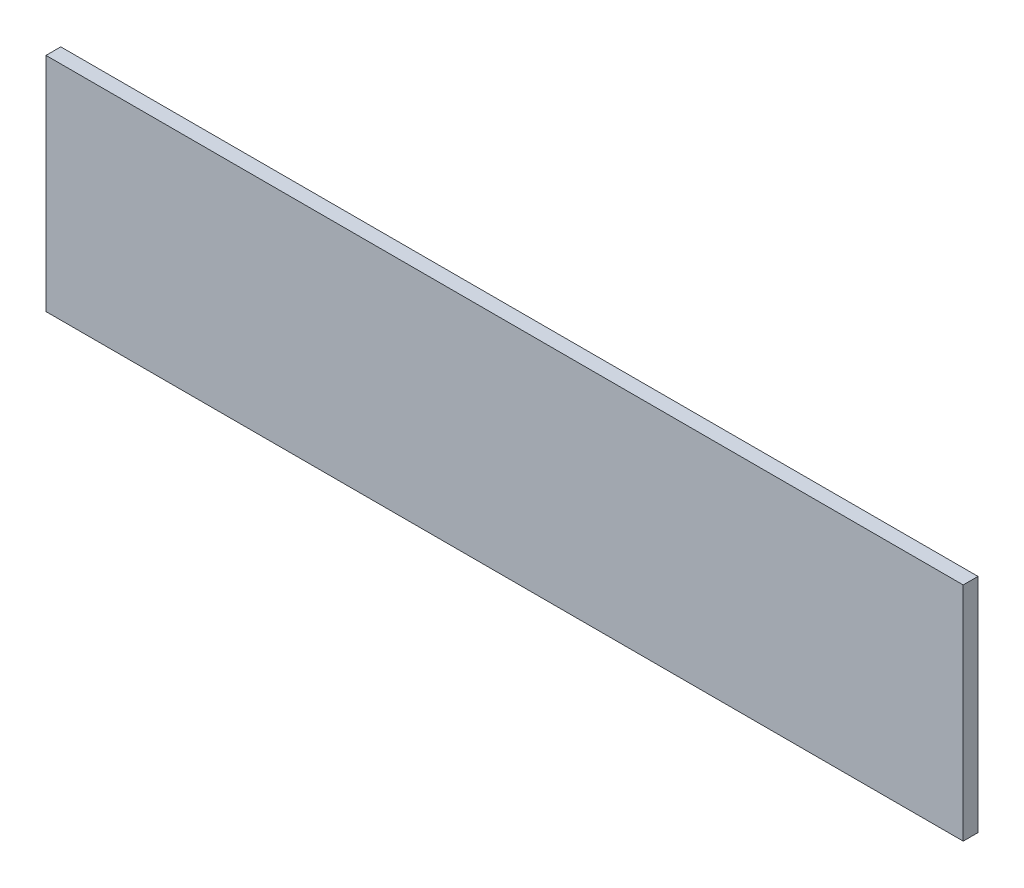
ISO-10303-21;
HEADER;
FILE_DESCRIPTION(('STEP AP214'),'2;1');
FILE_NAME('part.step','',(''),(''),'','','');
FILE_SCHEMA(('AUTOMOTIVE_DESIGN { 1 0 10303 214 1 1 1 1 }'));
ENDSEC;
DATA;
#1=APPLICATION_CONTEXT('core data for automotive mechanical design processes');
#2=APPLICATION_PROTOCOL_DEFINITION('international standard','automotive_design',2000,#1);
#3=PRODUCT_CONTEXT('',#1,'mechanical');
#4=PRODUCT('Part','Part','',(#3));
#5=PRODUCT_RELATED_PRODUCT_CATEGORY('part','',(#4));
#6=PRODUCT_DEFINITION_FORMATION('','',#4);
#7=PRODUCT_DEFINITION_CONTEXT('part definition',#1,'design');
#8=PRODUCT_DEFINITION('design','',#6,#7);
#9=PRODUCT_DEFINITION_SHAPE('','',#8);
#10=(LENGTH_UNIT() NAMED_UNIT(*) SI_UNIT(.MILLI.,.METRE.));
#11=(NAMED_UNIT(*) PLANE_ANGLE_UNIT() SI_UNIT($,.RADIAN.));
#12=(NAMED_UNIT(*) SI_UNIT($,.STERADIAN.) SOLID_ANGLE_UNIT());
#13=UNCERTAINTY_MEASURE_WITH_UNIT(LENGTH_MEASURE(1.E-05),#10,'distance_accuracy_value','');
#14=(GEOMETRIC_REPRESENTATION_CONTEXT(3) GLOBAL_UNCERTAINTY_ASSIGNED_CONTEXT((#13)) GLOBAL_UNIT_ASSIGNED_CONTEXT((#10,
#11,#12)) REPRESENTATION_CONTEXT('',''));
#15=CARTESIAN_POINT('',(0.,0.,0.));
#16=DIRECTION('',(0.,0.,1.));
#17=DIRECTION('',(1.,0.,0.));
#18=AXIS2_PLACEMENT_3D('',#15,#16,#17);
#19=CARTESIAN_POINT('',(-62.,-15.,2.));
#20=DIRECTION('',(1.,0.,0.));
#21=DIRECTION('',(0.,0.,-1.));
#22=AXIS2_PLACEMENT_3D('',#19,#20,#21);
#23=PLANE('',#22);
#24=DIRECTION('',(0.,-1.,0.));
#25=VECTOR('',#24,1.);
#26=CARTESIAN_POINT('',(-62.,-15.,0.));
#27=LINE('',#26,#25);
#28=CARTESIAN_POINT('',(-62.,15.,0.));
#29=VERTEX_POINT('',#28);
#30=CARTESIAN_POINT('',(-62.,-15.,0.));
#31=VERTEX_POINT('',#30);
#32=EDGE_CURVE('E104',#29,#31,#27,.T.);
#33=ORIENTED_EDGE('',*,*,#32,.T.);
#34=DIRECTION('',(0.,0.,-1.));
#35=VECTOR('',#34,1.);
#36=CARTESIAN_POINT('',(-62.,-15.,2.));
#37=LINE('',#36,#35);
#38=CARTESIAN_POINT('',(-62.,-15.,2.));
#39=VERTEX_POINT('',#38);
#40=EDGE_CURVE('E11',#39,#31,#37,.T.);
#41=ORIENTED_EDGE('',*,*,#40,.F.);
#42=DIRECTION('',(0.,-1.,0.));
#43=VECTOR('',#42,1.);
#44=CARTESIAN_POINT('',(-62.,-15.,2.));
#45=LINE('',#44,#43);
#46=CARTESIAN_POINT('',(-62.,15.,2.));
#47=VERTEX_POINT('',#46);
#48=EDGE_CURVE('E87',#47,#39,#45,.T.);
#49=ORIENTED_EDGE('',*,*,#48,.F.);
#50=DIRECTION('',(0.,0.,-1.));
#51=VECTOR('',#50,1.);
#52=CARTESIAN_POINT('',(-62.,15.,2.));
#53=LINE('',#52,#51);
#54=EDGE_CURVE('E100',#47,#29,#53,.T.);
#55=ORIENTED_EDGE('',*,*,#54,.T.);
#56=EDGE_LOOP('',(#33,#41,#49,#55));
#57=FACE_BOUND('',#56,.T.);
#58=ADVANCED_FACE('F36',(#57),#23,.F.);
#59=CARTESIAN_POINT('',(62.,-15.,2.));
#60=DIRECTION('',(0.,1.,0.));
#61=DIRECTION('',(-1.,0.,0.));
#62=AXIS2_PLACEMENT_3D('',#59,#60,#61);
#63=PLANE('',#62);
#64=DIRECTION('',(1.,0.,0.));
#65=VECTOR('',#64,1.);
#66=CARTESIAN_POINT('',(62.,-15.,0.));
#67=LINE('',#66,#65);
#68=CARTESIAN_POINT('',(62.,-15.,0.));
#69=VERTEX_POINT('',#68);
#70=EDGE_CURVE('E92',#31,#69,#67,.T.);
#71=ORIENTED_EDGE('',*,*,#70,.T.);
#72=DIRECTION('',(0.,0.,-1.));
#73=VECTOR('',#72,1.);
#74=CARTESIAN_POINT('',(62.,-15.,2.));
#75=LINE('',#74,#73);
#76=CARTESIAN_POINT('',(62.,-15.,2.));
#77=VERTEX_POINT('',#76);
#78=EDGE_CURVE('E44',#77,#69,#75,.T.);
#79=ORIENTED_EDGE('',*,*,#78,.F.);
#80=DIRECTION('',(1.,0.,0.));
#81=VECTOR('',#80,1.);
#82=CARTESIAN_POINT('',(62.,-15.,2.));
#83=LINE('',#82,#81);
#84=EDGE_CURVE('E82',#39,#77,#83,.T.);
#85=ORIENTED_EDGE('',*,*,#84,.F.);
#86=ORIENTED_EDGE('',*,*,#40,.T.);
#87=EDGE_LOOP('',(#71,#79,#85,#86));
#88=FACE_BOUND('',#87,.T.);
#89=ADVANCED_FACE('F91',(#88),#63,.F.);
#90=CARTESIAN_POINT('',(62.,-15.,2.));
#91=DIRECTION('',(-1.,0.,0.));
#92=DIRECTION('',(0.,-1.,0.));
#93=AXIS2_PLACEMENT_3D('',#90,#91,#92);
#94=PLANE('',#93);
#95=DIRECTION('',(0.,1.,0.));
#96=VECTOR('',#95,1.);
#97=CARTESIAN_POINT('',(62.,-15.,0.));
#98=LINE('',#97,#96);
#99=CARTESIAN_POINT('',(62.,15.,0.));
#100=VERTEX_POINT('',#99);
#101=EDGE_CURVE('E69',#69,#100,#98,.T.);
#102=ORIENTED_EDGE('',*,*,#101,.T.);
#103=DIRECTION('',(0.,0.,-1.));
#104=VECTOR('',#103,1.);
#105=CARTESIAN_POINT('',(62.,15.,2.));
#106=LINE('',#105,#104);
#107=CARTESIAN_POINT('',(62.,15.,2.));
#108=VERTEX_POINT('',#107);
#109=EDGE_CURVE('E93',#108,#100,#106,.T.);
#110=ORIENTED_EDGE('',*,*,#109,.F.);
#111=DIRECTION('',(0.,1.,0.));
#112=VECTOR('',#111,1.);
#113=CARTESIAN_POINT('',(62.,-15.,2.));
#114=LINE('',#113,#112);
#115=EDGE_CURVE('E85',#77,#108,#114,.T.);
#116=ORIENTED_EDGE('',*,*,#115,.F.);
#117=ORIENTED_EDGE('',*,*,#78,.T.);
#118=EDGE_LOOP('',(#102,#110,#116,#117));
#119=FACE_BOUND('',#118,.T.);
#120=ADVANCED_FACE('F94',(#119),#94,.F.);
#121=CARTESIAN_POINT('',(62.,15.,2.));
#122=DIRECTION('',(0.,-1.,0.));
#123=DIRECTION('',(1.,0.,0.));
#124=AXIS2_PLACEMENT_3D('',#121,#122,#123);
#125=PLANE('',#124);
#126=DIRECTION('',(-1.,0.,0.));
#127=VECTOR('',#126,1.);
#128=CARTESIAN_POINT('',(62.,15.,0.));
#129=LINE('',#128,#127);
#130=EDGE_CURVE('E75',#100,#29,#129,.T.);
#131=ORIENTED_EDGE('',*,*,#130,.T.);
#132=ORIENTED_EDGE('',*,*,#54,.F.);
#133=DIRECTION('',(-1.,0.,0.));
#134=VECTOR('',#133,1.);
#135=CARTESIAN_POINT('',(62.,15.,2.));
#136=LINE('',#135,#134);
#137=EDGE_CURVE('E52',#108,#47,#136,.T.);
#138=ORIENTED_EDGE('',*,*,#137,.F.);
#139=ORIENTED_EDGE('',*,*,#109,.T.);
#140=EDGE_LOOP('',(#131,#132,#138,#139));
#141=FACE_BOUND('',#140,.T.);
#142=ADVANCED_FACE('F114',(#141),#125,.F.);
#143=CARTESIAN_POINT('',(0.,0.,2.));
#144=DIRECTION('',(0.,0.,1.));
#145=DIRECTION('',(1.,0.,0.));
#146=AXIS2_PLACEMENT_3D('',#143,#144,#145);
#147=PLANE('',#146);
#148=ORIENTED_EDGE('',*,*,#48,.T.);
#149=ORIENTED_EDGE('',*,*,#84,.T.);
#150=ORIENTED_EDGE('',*,*,#115,.T.);
#151=ORIENTED_EDGE('',*,*,#137,.T.);
#152=EDGE_LOOP('',(#148,#149,#150,#151));
#153=FACE_BOUND('',#152,.T.);
#154=ADVANCED_FACE('F83',(#153),#147,.T.);
#155=CARTESIAN_POINT('',(0.,0.,0.));
#156=DIRECTION('',(0.,0.,1.));
#157=DIRECTION('',(1.,0.,0.));
#158=AXIS2_PLACEMENT_3D('',#155,#156,#157);
#159=PLANE('',#158);
#160=ORIENTED_EDGE('',*,*,#32,.F.);
#161=ORIENTED_EDGE('',*,*,#130,.F.);
#162=ORIENTED_EDGE('',*,*,#101,.F.);
#163=ORIENTED_EDGE('',*,*,#70,.F.);
#164=EDGE_LOOP('',(#160,#161,#162,#163));
#165=FACE_BOUND('',#164,.T.);
#166=ADVANCED_FACE('F117',(#165),#159,.F.);
#167=CLOSED_SHELL('',(#58,#89,#120,#142,#154,#166));
#168=MANIFOLD_SOLID_BREP('B2',#167);
#169=ADVANCED_BREP_SHAPE_REPRESENTATION('',(#18,#168),#14);
#170=SHAPE_DEFINITION_REPRESENTATION(#9,#169);
ENDSEC;
END-ISO-10303-21;
